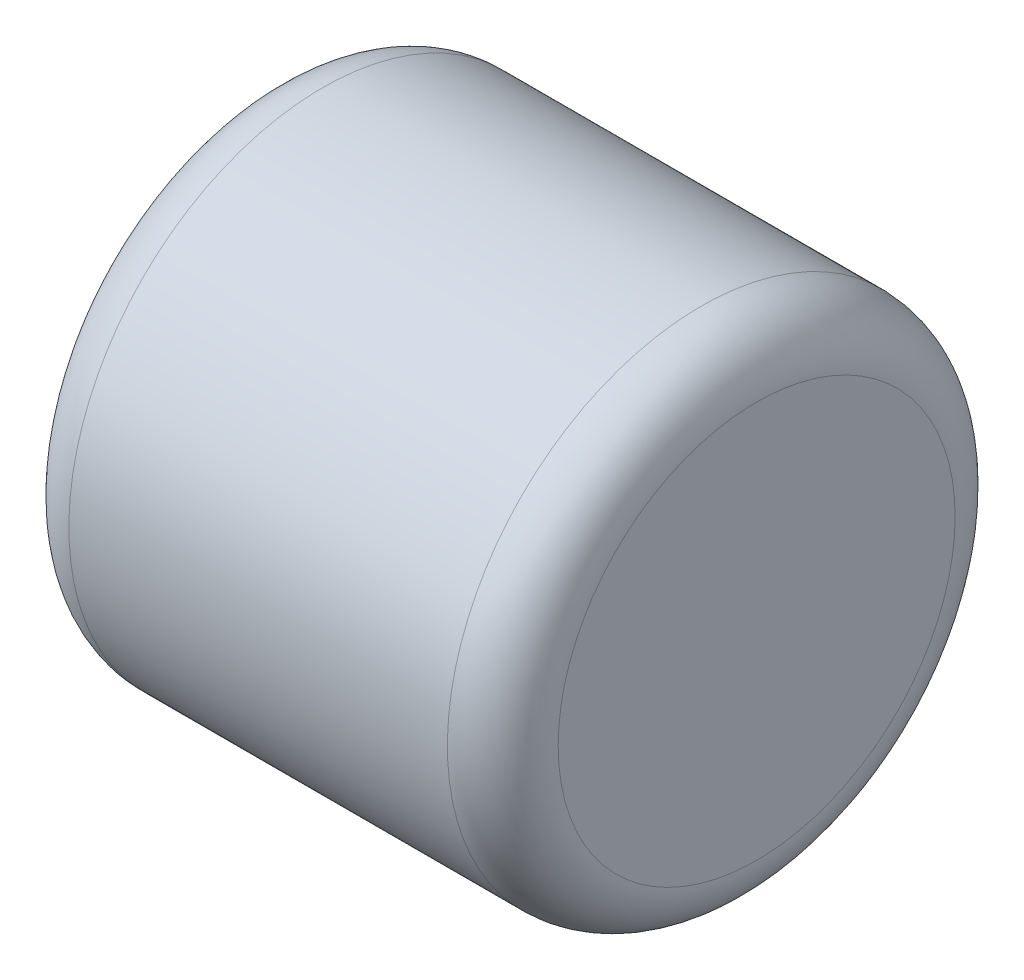
ISO-10303-21;
HEADER;
FILE_DESCRIPTION(('STEP AP214'),'2;1');
FILE_NAME('part.step','',(''),(''),'','','');
FILE_SCHEMA(('AUTOMOTIVE_DESIGN { 1 0 10303 214 1 1 1 1 }'));
ENDSEC;
DATA;
#1=APPLICATION_CONTEXT('core data for automotive mechanical design processes');
#2=APPLICATION_PROTOCOL_DEFINITION('international standard','automotive_design',2000,#1);
#3=PRODUCT_CONTEXT('',#1,'mechanical');
#4=PRODUCT('Part','Part','',(#3));
#5=PRODUCT_RELATED_PRODUCT_CATEGORY('part','',(#4));
#6=PRODUCT_DEFINITION_FORMATION('','',#4);
#7=PRODUCT_DEFINITION_CONTEXT('part definition',#1,'design');
#8=PRODUCT_DEFINITION('design','',#6,#7);
#9=PRODUCT_DEFINITION_SHAPE('','',#8);
#10=(LENGTH_UNIT() NAMED_UNIT(*) SI_UNIT(.MILLI.,.METRE.));
#11=(NAMED_UNIT(*) PLANE_ANGLE_UNIT() SI_UNIT($,.RADIAN.));
#12=(NAMED_UNIT(*) SI_UNIT($,.STERADIAN.) SOLID_ANGLE_UNIT());
#13=UNCERTAINTY_MEASURE_WITH_UNIT(LENGTH_MEASURE(1.E-05),#10,'distance_accuracy_value','');
#14=(GEOMETRIC_REPRESENTATION_CONTEXT(3) GLOBAL_UNCERTAINTY_ASSIGNED_CONTEXT((#13)) GLOBAL_UNIT_ASSIGNED_CONTEXT((#10,
#11,#12)) REPRESENTATION_CONTEXT('',''));
#15=CARTESIAN_POINT('',(0.,0.,0.));
#16=DIRECTION('',(0.,0.,1.));
#17=DIRECTION('',(1.,0.,0.));
#18=AXIS2_PLACEMENT_3D('',#15,#16,#17);
#19=CARTESIAN_POINT('',(8.15,12.4,-1.075));
#20=DIRECTION('',(1.,0.,0.));
#21=DIRECTION('',(0.,0.,-1.));
#22=AXIS2_PLACEMENT_3D('',#19,#20,#21);
#23=PLANE('',#22);
#24=CARTESIAN_POINT('',(8.15,12.4,0.));
#25=DIRECTION('',(-1.,0.,0.));
#26=DIRECTION('',(0.,0.,-1.));
#27=AXIS2_PLACEMENT_3D('',#24,#25,#26);
#28=CIRCLE('',#27,2.15);
#29=CARTESIAN_POINT('',(8.15,12.4,-2.15));
#30=VERTEX_POINT('',#29);
#31=EDGE_CURVE('E61',#30,#30,#28,.T.);
#32=ORIENTED_EDGE('',*,*,#31,.F.);
#33=EDGE_LOOP('',(#32));
#34=FACE_BOUND('',#33,.T.);
#35=ADVANCED_FACE('F14',(#34),#23,.T.);
#36=CARTESIAN_POINT('',(2.85,12.4,-1.075));
#37=DIRECTION('',(-1.,0.,0.));
#38=DIRECTION('',(0.,-1.,0.));
#39=AXIS2_PLACEMENT_3D('',#36,#37,#38);
#40=PLANE('',#39);
#41=CARTESIAN_POINT('',(2.85,12.4,0.));
#42=DIRECTION('',(1.,0.,0.));
#43=DIRECTION('',(0.,0.,-1.));
#44=AXIS2_PLACEMENT_3D('',#41,#42,#43);
#45=CIRCLE('',#44,2.15);
#46=CARTESIAN_POINT('',(2.85,12.4,-2.15));
#47=VERTEX_POINT('',#46);
#48=EDGE_CURVE('E29',#47,#47,#45,.T.);
#49=ORIENTED_EDGE('',*,*,#48,.F.);
#50=EDGE_LOOP('',(#49));
#51=FACE_BOUND('',#50,.T.);
#52=ADVANCED_FACE('F74',(#51),#40,.T.);
#53=CARTESIAN_POINT('',(7.55,12.4,0.));
#54=DIRECTION('',(-1.,0.,0.));
#55=DIRECTION('',(0.,1.,0.));
#56=AXIS2_PLACEMENT_3D('',#53,#54,#55);
#57=TOROIDAL_SURFACE('',#56,2.15,0.600000000000001);
#58=ORIENTED_EDGE('',*,*,#31,.T.);
#59=EDGE_LOOP('',(#58));
#60=FACE_BOUND('',#59,.T.);
#61=CARTESIAN_POINT('',(7.55,12.4,0.));
#62=DIRECTION('',(-1.,0.,0.));
#63=DIRECTION('',(0.,-1.,0.));
#64=AXIS2_PLACEMENT_3D('',#61,#62,#63);
#65=CIRCLE('',#64,2.75);
#66=CARTESIAN_POINT('',(7.55,9.65,0.));
#67=VERTEX_POINT('',#66);
#68=EDGE_CURVE('E24',#67,#67,#65,.T.);
#69=ORIENTED_EDGE('',*,*,#68,.F.);
#70=EDGE_LOOP('',(#69));
#71=FACE_BOUND('',#70,.T.);
#72=ADVANCED_FACE('F42',(#60,#71),#57,.T.);
#73=CARTESIAN_POINT('',(3.45,12.4,0.));
#74=DIRECTION('',(-1.,0.,0.));
#75=DIRECTION('',(0.,1.,0.));
#76=AXIS2_PLACEMENT_3D('',#73,#74,#75);
#77=TOROIDAL_SURFACE('',#76,2.15,0.6);
#78=CARTESIAN_POINT('',(3.45,12.4,0.));
#79=DIRECTION('',(-1.,0.,0.));
#80=DIRECTION('',(0.,-1.,0.));
#81=AXIS2_PLACEMENT_3D('',#78,#79,#80);
#82=CIRCLE('',#81,2.75);
#83=CARTESIAN_POINT('',(3.45,9.65,0.));
#84=VERTEX_POINT('',#83);
#85=EDGE_CURVE('E10',#84,#84,#82,.F.);
#86=ORIENTED_EDGE('',*,*,#85,.F.);
#87=EDGE_LOOP('',(#86));
#88=FACE_BOUND('',#87,.T.);
#89=ORIENTED_EDGE('',*,*,#48,.T.);
#90=EDGE_LOOP('',(#89));
#91=FACE_BOUND('',#90,.T.);
#92=ADVANCED_FACE('F37',(#88,#91),#77,.T.);
#93=CARTESIAN_POINT('',(5.5,12.4,0.));
#94=DIRECTION('',(-1.,0.,0.));
#95=DIRECTION('',(0.,-1.,0.));
#96=AXIS2_PLACEMENT_3D('',#93,#94,#95);
#97=CYLINDRICAL_SURFACE('',#96,2.75);
#98=ORIENTED_EDGE('',*,*,#68,.T.);
#99=EDGE_LOOP('',(#98));
#100=FACE_BOUND('',#99,.T.);
#101=ORIENTED_EDGE('',*,*,#85,.T.);
#102=EDGE_LOOP('',(#101));
#103=FACE_BOUND('',#102,.T.);
#104=ADVANCED_FACE('F41',(#100,#103),#97,.T.);
#105=CLOSED_SHELL('',(#35,#52,#72,#92,#104));
#106=MANIFOLD_SOLID_BREP('B1',#105);
#107=ADVANCED_BREP_SHAPE_REPRESENTATION('',(#18,#106),#14);
#108=SHAPE_DEFINITION_REPRESENTATION(#9,#107);
ENDSEC;
END-ISO-10303-21;
